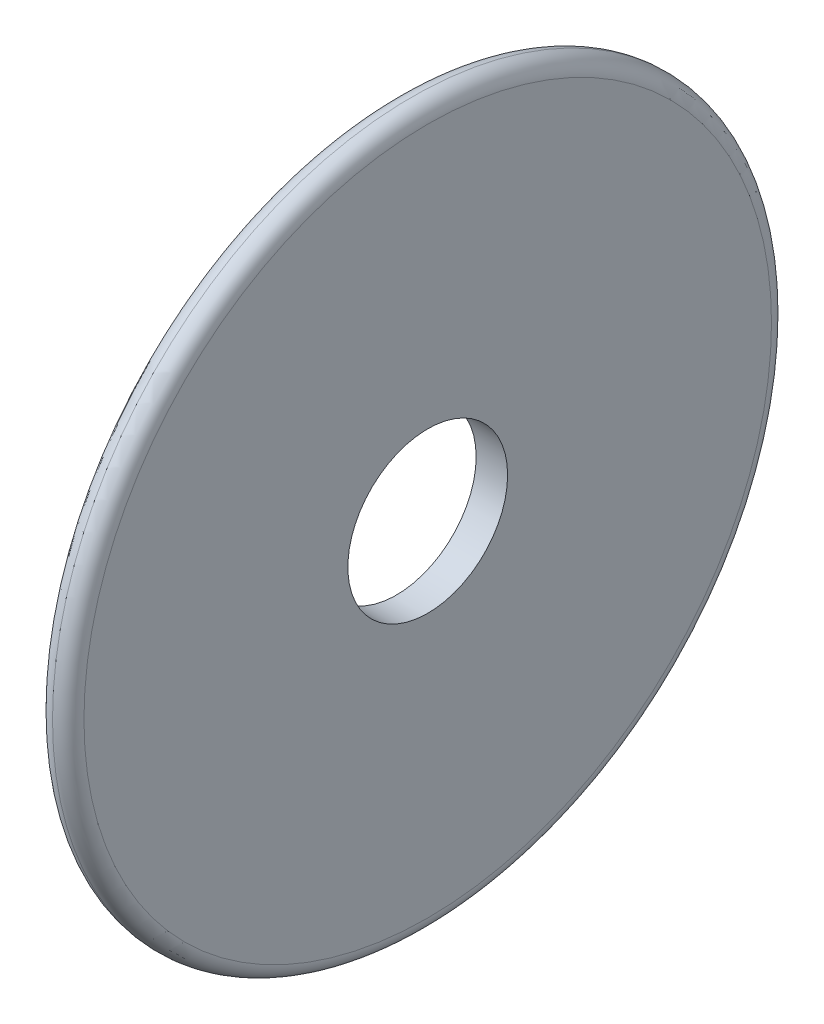
ISO-10303-21;
HEADER;
FILE_DESCRIPTION(('STEP AP214'),'2;1');
FILE_NAME('part.step','',(''),(''),'','','');
FILE_SCHEMA(('AUTOMOTIVE_DESIGN { 1 0 10303 214 1 1 1 1 }'));
ENDSEC;
DATA;
#1=APPLICATION_CONTEXT('core data for automotive mechanical design processes');
#2=APPLICATION_PROTOCOL_DEFINITION('international standard','automotive_design',2000,#1);
#3=PRODUCT_CONTEXT('',#1,'mechanical');
#4=PRODUCT('Part','Part','',(#3));
#5=PRODUCT_RELATED_PRODUCT_CATEGORY('part','',(#4));
#6=PRODUCT_DEFINITION_FORMATION('','',#4);
#7=PRODUCT_DEFINITION_CONTEXT('part definition',#1,'design');
#8=PRODUCT_DEFINITION('design','',#6,#7);
#9=PRODUCT_DEFINITION_SHAPE('','',#8);
#10=(LENGTH_UNIT() NAMED_UNIT(*) SI_UNIT(.MILLI.,.METRE.));
#11=(NAMED_UNIT(*) PLANE_ANGLE_UNIT() SI_UNIT($,.RADIAN.));
#12=(NAMED_UNIT(*) SI_UNIT($,.STERADIAN.) SOLID_ANGLE_UNIT());
#13=UNCERTAINTY_MEASURE_WITH_UNIT(LENGTH_MEASURE(1.E-05),#10,'distance_accuracy_value','');
#14=(GEOMETRIC_REPRESENTATION_CONTEXT(3) GLOBAL_UNCERTAINTY_ASSIGNED_CONTEXT((#13)) GLOBAL_UNIT_ASSIGNED_CONTEXT((#10,
#11,#12)) REPRESENTATION_CONTEXT('',''));
#15=CARTESIAN_POINT('',(0.,0.,0.));
#16=DIRECTION('',(0.,0.,1.));
#17=DIRECTION('',(1.,0.,0.));
#18=AXIS2_PLACEMENT_3D('',#15,#16,#17);
#19=CARTESIAN_POINT('',(5.,0.,0.));
#20=DIRECTION('',(1.,0.,0.));
#21=DIRECTION('',(0.,0.,-1.));
#22=AXIS2_PLACEMENT_3D('',#19,#20,#21);
#23=PLANE('',#22);
#24=CARTESIAN_POINT('',(5.,0.,0.));
#25=DIRECTION('',(1.,0.,0.));
#26=DIRECTION('',(0.,0.,-1.));
#27=AXIS2_PLACEMENT_3D('',#24,#25,#26);
#28=CIRCLE('',#27,54.65);
#29=CARTESIAN_POINT('',(5.,0.,-54.65));
#30=VERTEX_POINT('',#29);
#31=EDGE_CURVE('E10',#30,#30,#28,.T.);
#32=ORIENTED_EDGE('',*,*,#31,.T.);
#33=EDGE_LOOP('',(#32));
#34=FACE_BOUND('',#33,.T.);
#35=CARTESIAN_POINT('',(5.,0.,0.));
#36=DIRECTION('',(1.,0.,0.));
#37=DIRECTION('',(0.,0.,-1.));
#38=AXIS2_PLACEMENT_3D('',#35,#36,#37);
#39=CIRCLE('',#38,12.7);
#40=CARTESIAN_POINT('',(5.,0.,-12.7));
#41=VERTEX_POINT('',#40);
#42=EDGE_CURVE('E46',#41,#41,#39,.T.);
#43=ORIENTED_EDGE('',*,*,#42,.F.);
#44=EDGE_LOOP('',(#43));
#45=FACE_BOUND('',#44,.T.);
#46=ADVANCED_FACE('F31',(#34,#45),#23,.T.);
#47=CARTESIAN_POINT('',(0.,0.,0.));
#48=DIRECTION('',(1.,0.,0.));
#49=DIRECTION('',(0.,0.,-1.));
#50=AXIS2_PLACEMENT_3D('',#47,#48,#49);
#51=PLANE('',#50);
#52=CARTESIAN_POINT('',(0.,0.,0.));
#53=DIRECTION('',(1.,0.,0.));
#54=DIRECTION('',(0.,0.,-1.));
#55=AXIS2_PLACEMENT_3D('',#52,#53,#54);
#56=CIRCLE('',#55,54.65);
#57=CARTESIAN_POINT('',(0.,0.,-54.65));
#58=VERTEX_POINT('',#57);
#59=EDGE_CURVE('E39',#58,#58,#56,.F.);
#60=ORIENTED_EDGE('',*,*,#59,.T.);
#61=EDGE_LOOP('',(#60));
#62=FACE_BOUND('',#61,.T.);
#63=CARTESIAN_POINT('',(0.,0.,0.));
#64=DIRECTION('',(1.,0.,0.));
#65=DIRECTION('',(0.,0.,-1.));
#66=AXIS2_PLACEMENT_3D('',#63,#64,#65);
#67=CIRCLE('',#66,12.7);
#68=CARTESIAN_POINT('',(0.,0.,-12.7));
#69=VERTEX_POINT('',#68);
#70=EDGE_CURVE('E43',#69,#69,#67,.T.);
#71=ORIENTED_EDGE('',*,*,#70,.T.);
#72=EDGE_LOOP('',(#71));
#73=FACE_BOUND('',#72,.T.);
#74=ADVANCED_FACE('F52',(#62,#73),#51,.F.);
#75=CARTESIAN_POINT('',(0.,0.,0.));
#76=DIRECTION('',(1.,0.,0.));
#77=DIRECTION('',(0.,0.,-1.));
#78=AXIS2_PLACEMENT_3D('',#75,#76,#77);
#79=CYLINDRICAL_SURFACE('',#78,12.7);
#80=ORIENTED_EDGE('',*,*,#70,.F.);
#81=EDGE_LOOP('',(#80));
#82=FACE_BOUND('',#81,.T.);
#83=ORIENTED_EDGE('',*,*,#42,.T.);
#84=EDGE_LOOP('',(#83));
#85=FACE_BOUND('',#84,.T.);
#86=ADVANCED_FACE('F54',(#82,#85),#79,.F.);
#87=CARTESIAN_POINT('',(2.5,0.,0.));
#88=DIRECTION('',(1.,0.,0.));
#89=DIRECTION('',(0.,0.,-1.));
#90=AXIS2_PLACEMENT_3D('',#87,#88,#89);
#91=TOROIDAL_SURFACE('',#90,54.65,2.5);
#92=ORIENTED_EDGE('',*,*,#31,.F.);
#93=EDGE_LOOP('',(#92));
#94=FACE_BOUND('',#93,.T.);
#95=CARTESIAN_POINT('',(2.5,0.,0.));
#96=DIRECTION('',(1.,0.,0.));
#97=DIRECTION('',(0.,0.,-1.));
#98=AXIS2_PLACEMENT_3D('',#95,#96,#97);
#99=CIRCLE('',#98,57.15);
#100=CARTESIAN_POINT('',(2.5,0.,-57.15));
#101=VERTEX_POINT('',#100);
#102=EDGE_CURVE('E35',#101,#101,#99,.F.);
#103=ORIENTED_EDGE('',*,*,#102,.F.);
#104=EDGE_LOOP('',(#103));
#105=FACE_BOUND('',#104,.T.);
#106=ADVANCED_FACE('F33',(#94,#105),#91,.T.);
#107=CARTESIAN_POINT('',(2.5,0.,0.));
#108=DIRECTION('',(1.,0.,0.));
#109=DIRECTION('',(0.,0.,-1.));
#110=AXIS2_PLACEMENT_3D('',#107,#108,#109);
#111=TOROIDAL_SURFACE('',#110,54.65,2.5);
#112=ORIENTED_EDGE('',*,*,#59,.F.);
#113=EDGE_LOOP('',(#112));
#114=FACE_BOUND('',#113,.T.);
#115=ORIENTED_EDGE('',*,*,#102,.T.);
#116=EDGE_LOOP('',(#115));
#117=FACE_BOUND('',#116,.T.);
#118=ADVANCED_FACE('F67',(#114,#117),#111,.T.);
#119=CLOSED_SHELL('',(#46,#74,#86,#106,#118));
#120=MANIFOLD_SOLID_BREP('B2',#119);
#121=ADVANCED_BREP_SHAPE_REPRESENTATION('',(#18,#120),#14);
#122=SHAPE_DEFINITION_REPRESENTATION(#9,#121);
ENDSEC;
END-ISO-10303-21;
